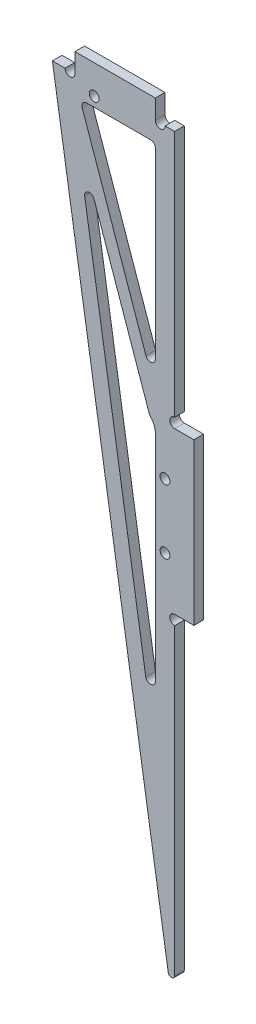
ISO-10303-21;
HEADER;
FILE_DESCRIPTION(('STEP AP214'),'2;1');
FILE_NAME('part.step','',(''),(''),'','','');
FILE_SCHEMA(('AUTOMOTIVE_DESIGN { 1 0 10303 214 1 1 1 1 }'));
ENDSEC;
DATA;
#1=APPLICATION_CONTEXT('core data for automotive mechanical design processes');
#2=APPLICATION_PROTOCOL_DEFINITION('international standard','automotive_design',2000,#1);
#3=PRODUCT_CONTEXT('',#1,'mechanical');
#4=PRODUCT('Part','Part','',(#3));
#5=PRODUCT_RELATED_PRODUCT_CATEGORY('part','',(#4));
#6=PRODUCT_DEFINITION_FORMATION('','',#4);
#7=PRODUCT_DEFINITION_CONTEXT('part definition',#1,'design');
#8=PRODUCT_DEFINITION('design','',#6,#7);
#9=PRODUCT_DEFINITION_SHAPE('','',#8);
#10=(LENGTH_UNIT() NAMED_UNIT(*) SI_UNIT(.MILLI.,.METRE.));
#11=(NAMED_UNIT(*) PLANE_ANGLE_UNIT() SI_UNIT($,.RADIAN.));
#12=(NAMED_UNIT(*) SI_UNIT($,.STERADIAN.) SOLID_ANGLE_UNIT());
#13=UNCERTAINTY_MEASURE_WITH_UNIT(LENGTH_MEASURE(1.E-05),#10,'distance_accuracy_value','');
#14=(GEOMETRIC_REPRESENTATION_CONTEXT(3) GLOBAL_UNCERTAINTY_ASSIGNED_CONTEXT((#13)) GLOBAL_UNIT_ASSIGNED_CONTEXT((#10,
#11,#12)) REPRESENTATION_CONTEXT('',''));
#15=CARTESIAN_POINT('',(0.,0.,0.));
#16=DIRECTION('',(0.,0.,1.));
#17=DIRECTION('',(1.,0.,0.));
#18=AXIS2_PLACEMENT_3D('',#15,#16,#17);
#19=CARTESIAN_POINT('',(-5.99999999999994,-5.99999999999979,60.));
#20=DIRECTION('',(1.,0.,0.));
#21=DIRECTION('',(0.,1.,0.));
#22=AXIS2_PLACEMENT_3D('',#19,#20,#21);
#23=PLANE('',#22);
#24=DIRECTION('',(0.,-1.,0.));
#25=VECTOR('',#24,1.);
#26=CARTESIAN_POINT('',(-5.99999999999994,0.,3.));
#27=LINE('',#26,#25);
#28=CARTESIAN_POINT('',(-5.99999999999995,-84.1827541414039,3.));
#29=VERTEX_POINT('',#28);
#30=CARTESIAN_POINT('',(-5.99999999999996,-151.067549311675,3.));
#31=VERTEX_POINT('',#30);
#32=EDGE_CURVE('E265',#29,#31,#27,.T.);
#33=ORIENTED_EDGE('',*,*,#32,.F.);
#34=DIRECTION('',(0.,0.,-1.));
#35=VECTOR('',#34,1.);
#36=CARTESIAN_POINT('',(-5.99999999999995,-84.1827541414039,60.));
#37=LINE('',#36,#35);
#38=CARTESIAN_POINT('',(-5.99999999999995,-84.1827541414039,0.));
#39=VERTEX_POINT('',#38);
#40=EDGE_CURVE('E435',#29,#39,#37,.T.);
#41=ORIENTED_EDGE('',*,*,#40,.T.);
#42=DIRECTION('',(0.,-1.,0.));
#43=VECTOR('',#42,1.);
#44=CARTESIAN_POINT('',(-5.99999999999994,-5.99999999999979,0.));
#45=LINE('',#44,#43);
#46=CARTESIAN_POINT('',(-5.99999999999996,-151.067549311675,0.));
#47=VERTEX_POINT('',#46);
#48=EDGE_CURVE('E258',#39,#47,#45,.T.);
#49=ORIENTED_EDGE('',*,*,#48,.T.);
#50=DIRECTION('',(0.,0.,-1.));
#51=VECTOR('',#50,1.);
#52=CARTESIAN_POINT('',(-5.99999999999996,-151.067549311675,3.));
#53=LINE('',#52,#51);
#54=EDGE_CURVE('E419',#47,#31,#53,.F.);
#55=ORIENTED_EDGE('',*,*,#54,.T.);
#56=EDGE_LOOP('',(#33,#41,#49,#55));
#57=FACE_BOUND('',#56,.T.);
#58=ADVANCED_FACE('F33',(#57),#23,.F.);
#59=CARTESIAN_POINT('',(0.,0.,3.));
#60=DIRECTION('',(-1.,0.,0.));
#61=DIRECTION('',(0.,-1.,0.));
#62=AXIS2_PLACEMENT_3D('',#59,#60,#61);
#63=PLANE('',#62);
#64=DIRECTION('',(0.,1.,0.));
#65=VECTOR('',#64,1.);
#66=CARTESIAN_POINT('',(0.,0.,3.));
#67=LINE('',#66,#65);
#68=CARTESIAN_POINT('',(0.,-76.9499999999999,3.));
#69=VERTEX_POINT('',#68);
#70=CARTESIAN_POINT('',(0.,0.,3.));
#71=VERTEX_POINT('',#70);
#72=EDGE_CURVE('E373',#69,#71,#67,.T.);
#73=ORIENTED_EDGE('',*,*,#72,.F.);
#74=DIRECTION('',(0.,0.,-1.));
#75=VECTOR('',#74,1.);
#76=CARTESIAN_POINT('',(0.,-76.9499999999999,40.));
#77=LINE('',#76,#75);
#78=CARTESIAN_POINT('',(0.,-76.9499999999999,0.));
#79=VERTEX_POINT('',#78);
#80=EDGE_CURVE('E285',#69,#79,#77,.T.);
#81=ORIENTED_EDGE('',*,*,#80,.T.);
#82=DIRECTION('',(0.,1.,0.));
#83=VECTOR('',#82,1.);
#84=CARTESIAN_POINT('',(0.,0.,0.));
#85=LINE('',#84,#83);
#86=CARTESIAN_POINT('',(0.,0.,0.));
#87=VERTEX_POINT('',#86);
#88=EDGE_CURVE('E385',#79,#87,#85,.T.);
#89=ORIENTED_EDGE('',*,*,#88,.T.);
#90=DIRECTION('',(0.,0.,-1.));
#91=VECTOR('',#90,1.);
#92=CARTESIAN_POINT('',(0.,0.,3.));
#93=LINE('',#92,#91);
#94=EDGE_CURVE('E394',#71,#87,#93,.T.);
#95=ORIENTED_EDGE('',*,*,#94,.F.);
#96=EDGE_LOOP('',(#73,#81,#89,#95));
#97=FACE_BOUND('',#96,.T.);
#98=ADVANCED_FACE('F515',(#97),#63,.F.);
#99=CARTESIAN_POINT('',(-38.,0.,3.));
#100=DIRECTION('',(0.,-1.,0.));
#101=DIRECTION('',(0.,0.,-1.));
#102=AXIS2_PLACEMENT_3D('',#99,#100,#101);
#103=PLANE('',#102);
#104=DIRECTION('',(-1.,0.,0.));
#105=VECTOR('',#104,1.);
#106=CARTESIAN_POINT('',(-38.,0.,3.));
#107=LINE('',#106,#105);
#108=CARTESIAN_POINT('',(-34.05,0.,3.));
#109=VERTEX_POINT('',#108);
#110=CARTESIAN_POINT('',(-38.,0.,3.));
#111=VERTEX_POINT('',#110);
#112=EDGE_CURVE('E377',#109,#111,#107,.T.);
#113=ORIENTED_EDGE('',*,*,#112,.F.);
#114=DIRECTION('',(0.,0.,-1.));
#115=VECTOR('',#114,1.);
#116=CARTESIAN_POINT('',(-34.05,0.,40.));
#117=LINE('',#116,#115);
#118=CARTESIAN_POINT('',(-34.05,0.,0.));
#119=VERTEX_POINT('',#118);
#120=EDGE_CURVE('E297',#109,#119,#117,.T.);
#121=ORIENTED_EDGE('',*,*,#120,.T.);
#122=DIRECTION('',(-1.,0.,0.));
#123=VECTOR('',#122,1.);
#124=CARTESIAN_POINT('',(-38.,0.,0.));
#125=LINE('',#124,#123);
#126=CARTESIAN_POINT('',(-38.,0.,0.));
#127=VERTEX_POINT('',#126);
#128=EDGE_CURVE('E389',#119,#127,#125,.T.);
#129=ORIENTED_EDGE('',*,*,#128,.T.);
#130=DIRECTION('',(0.,0.,-1.));
#131=VECTOR('',#130,1.);
#132=CARTESIAN_POINT('',(-38.,0.,3.));
#133=LINE('',#132,#131);
#134=EDGE_CURVE('E381',#111,#127,#133,.T.);
#135=ORIENTED_EDGE('',*,*,#134,.F.);
#136=EDGE_LOOP('',(#113,#121,#129,#135));
#137=FACE_BOUND('',#136,.T.);
#138=ADVANCED_FACE('F520',(#137),#103,.F.);
#139=CARTESIAN_POINT('',(0.,-240.,3.));
#140=DIRECTION('',(0.987696138674997,0.156385221956875,0.));
#141=DIRECTION('',(-0.156385221956875,0.987696138674997,0.));
#142=AXIS2_PLACEMENT_3D('',#139,#140,#141);
#143=PLANE('',#142);
#144=DIRECTION('',(0.156385221956875,-0.987696138674997,0.));
#145=VECTOR('',#144,1.);
#146=CARTESIAN_POINT('',(0.,-240.,0.));
#147=LINE('',#146,#145);
#148=CARTESIAN_POINT('',(-1.98769613867497,-227.446129650474,0.));
#149=VERTEX_POINT('',#148);
#150=EDGE_CURVE('E382',#127,#149,#147,.T.);
#151=ORIENTED_EDGE('',*,*,#150,.T.);
#152=DIRECTION('',(0.,0.,-1.));
#153=VECTOR('',#152,1.);
#154=CARTESIAN_POINT('',(-1.98769613867497,-227.446129650474,3.));
#155=LINE('',#154,#153);
#156=CARTESIAN_POINT('',(-1.98769613867497,-227.446129650474,3.));
#157=VERTEX_POINT('',#156);
#158=EDGE_CURVE('E409',#149,#157,#155,.F.);
#159=ORIENTED_EDGE('',*,*,#158,.T.);
#160=DIRECTION('',(0.156385221956875,-0.987696138674997,0.));
#161=VECTOR('',#160,1.);
#162=CARTESIAN_POINT('',(0.,-240.,3.));
#163=LINE('',#162,#161);
#164=EDGE_CURVE('E370',#111,#157,#163,.T.);
#165=ORIENTED_EDGE('',*,*,#164,.F.);
#166=ORIENTED_EDGE('',*,*,#134,.T.);
#167=EDGE_LOOP('',(#151,#159,#165,#166));
#168=FACE_BOUND('',#167,.T.);
#169=ADVANCED_FACE('F627',(#168),#143,.F.);
#170=CARTESIAN_POINT('',(0.,-227.289744428517,3.));
#171=VERTEX_POINT('',#170);
#172=CARTESIAN_POINT('',(0.,-133.05,3.));
#173=VERTEX_POINT('',#172);
#174=EDGE_CURVE('E375',#171,#173,#67,.T.);
#175=ORIENTED_EDGE('',*,*,#174,.F.);
#176=DIRECTION('',(0.,0.,-1.));
#177=VECTOR('',#176,1.);
#178=CARTESIAN_POINT('',(0.,-227.289744428517,3.));
#179=LINE('',#178,#177);
#180=CARTESIAN_POINT('',(0.,-227.289744428517,0.));
#181=VERTEX_POINT('',#180);
#182=EDGE_CURVE('E397',#171,#181,#179,.T.);
#183=ORIENTED_EDGE('',*,*,#182,.T.);
#184=CARTESIAN_POINT('',(0.,-133.05,0.));
#185=VERTEX_POINT('',#184);
#186=EDGE_CURVE('E387',#181,#185,#85,.T.);
#187=ORIENTED_EDGE('',*,*,#186,.T.);
#188=DIRECTION('',(0.,0.,-1.));
#189=VECTOR('',#188,1.);
#190=CARTESIAN_POINT('',(0.,-133.05,40.));
#191=LINE('',#190,#189);
#192=EDGE_CURVE('E291',#185,#173,#191,.F.);
#193=ORIENTED_EDGE('',*,*,#192,.T.);
#194=EDGE_LOOP('',(#175,#183,#187,#193));
#195=FACE_BOUND('',#194,.T.);
#196=ADVANCED_FACE('F523',(#195),#63,.F.);
#197=CARTESIAN_POINT('',(-2.95,0.,0.));
#198=VERTEX_POINT('',#197);
#199=EDGE_CURVE('E374',#87,#198,#125,.T.);
#200=ORIENTED_EDGE('',*,*,#199,.T.);
#201=DIRECTION('',(0.,0.,-1.));
#202=VECTOR('',#201,1.);
#203=CARTESIAN_POINT('',(-2.95,0.,40.));
#204=LINE('',#203,#202);
#205=CARTESIAN_POINT('',(-2.95,0.,3.));
#206=VERTEX_POINT('',#205);
#207=EDGE_CURVE('E303',#198,#206,#204,.F.);
#208=ORIENTED_EDGE('',*,*,#207,.T.);
#209=EDGE_CURVE('E378',#71,#206,#107,.T.);
#210=ORIENTED_EDGE('',*,*,#209,.F.);
#211=ORIENTED_EDGE('',*,*,#94,.T.);
#212=EDGE_LOOP('',(#200,#208,#210,#211));
#213=FACE_BOUND('',#212,.T.);
#214=ADVANCED_FACE('F565',(#213),#103,.F.);
#215=CARTESIAN_POINT('',(0.,0.,3.));
#216=DIRECTION('',(0.,0.,-1.));
#217=DIRECTION('',(-1.,0.,0.));
#218=AXIS2_PLACEMENT_3D('',#215,#216,#217);
#219=PLANE('',#218);
#220=CARTESIAN_POINT('',(-5.99999999999995,-79.2837746558375,3.));
#221=DIRECTION('',(0.,0.,-1.));
#222=DIRECTION('',(-1.,0.,0.));
#223=AXIS2_PLACEMENT_3D('',#220,#221,#222);
#224=CIRCLE('',#223,2.);
#225=CARTESIAN_POINT('',(-7.88846957543033,-79.9423205256703,3.));
#226=VERTEX_POINT('',#225);
#227=CARTESIAN_POINT('',(-7.42857142857137,-80.6834830802851,3.));
#228=VERTEX_POINT('',#227);
#229=EDGE_CURVE('E240',#226,#228,#224,.F.);
#230=ORIENTED_EDGE('',*,*,#229,.T.);
#231=CARTESIAN_POINT('',(-10.9999999999999,-84.1827541414039,3.));
#232=DIRECTION('',(0.,0.,-1.));
#233=DIRECTION('',(-1.,0.,0.));
#234=AXIS2_PLACEMENT_3D('',#231,#232,#233);
#235=CIRCLE('',#234,5.);
#236=EDGE_CURVE('E441',#228,#29,#235,.T.);
#237=ORIENTED_EDGE('',*,*,#236,.T.);
#238=ORIENTED_EDGE('',*,*,#32,.T.);
#239=CARTESIAN_POINT('',(-7.49999999999996,-151.067549311675,3.));
#240=DIRECTION('',(0.,0.,-1.));
#241=DIRECTION('',(-1.,0.,0.));
#242=AXIS2_PLACEMENT_3D('',#239,#240,#241);
#243=CIRCLE('',#242,1.5);
#244=CARTESIAN_POINT('',(-8.98154420801245,-151.302127144611,3.));
#245=VERTEX_POINT('',#244);
#246=EDGE_CURVE('E428',#31,#245,#243,.T.);
#247=ORIENTED_EDGE('',*,*,#246,.T.);
#248=DIRECTION('',(-0.156385221956875,0.987696138674997,0.));
#249=VECTOR('',#248,1.);
#250=CARTESIAN_POINT('',(-32.132178476058,-5.08759492537584,3.));
#251=LINE('',#250,#249);
#252=CARTESIAN_POINT('',(-27.9643827139141,-31.4105155283896,3.));
#253=VERTEX_POINT('',#252);
#254=EDGE_CURVE('E269',#245,#253,#251,.T.);
#255=ORIENTED_EDGE('',*,*,#254,.T.);
#256=CARTESIAN_POINT('',(-26.4828385059016,-31.1759376954543,3.));
#257=DIRECTION('',(0.,0.,-1.));
#258=DIRECTION('',(-1.,0.,0.));
#259=AXIS2_PLACEMENT_3D('',#256,#257,#258);
#260=CIRCLE('',#259,1.5);
#261=CARTESIAN_POINT('',(-25.0664863243288,-30.6820282930797,3.));
#262=VERTEX_POINT('',#261);
#263=EDGE_CURVE('E456',#253,#262,#260,.T.);
#264=ORIENTED_EDGE('',*,*,#263,.T.);
#265=DIRECTION('',(0.329272934916389,-0.944234787715189,0.));
#266=VECTOR('',#265,1.);
#267=CARTESIAN_POINT('',(-7.88846957543033,-79.9423205256703,3.));
#268=LINE('',#267,#266);
#269=EDGE_CURVE('E254',#262,#226,#268,.T.);
#270=ORIENTED_EDGE('',*,*,#269,.T.);
#271=EDGE_LOOP('',(#230,#237,#238,#247,#255,#264,#270));
#272=FACE_BOUND('',#271,.T.);
#273=CARTESIAN_POINT('',(-5.99999999999994,-7.49999999999979,3.));
#274=VERTEX_POINT('',#273);
#275=CARTESIAN_POINT('',(-5.99999999999995,-64.3528414990594,3.));
#276=VERTEX_POINT('',#275);
#277=EDGE_CURVE('E266',#274,#276,#27,.T.);
#278=ORIENTED_EDGE('',*,*,#277,.T.);
#279=CARTESIAN_POINT('',(-7.49999999999995,-64.3528414990594,3.));
#280=DIRECTION('',(0.,0.,-1.));
#281=DIRECTION('',(-1.,0.,0.));
#282=AXIS2_PLACEMENT_3D('',#279,#280,#281);
#283=CIRCLE('',#282,1.5);
#284=CARTESIAN_POINT('',(-8.91635218157273,-64.8467509014339,3.));
#285=VERTEX_POINT('',#284);
#286=EDGE_CURVE('E460',#276,#285,#283,.T.);
#287=ORIENTED_EDGE('',*,*,#286,.T.);
#288=DIRECTION('',(-0.329272934916389,0.944234787715189,0.));
#289=VECTOR('',#288,1.);
#290=CARTESIAN_POINT('',(-4.11153042456958,-78.6252287860048,3.));
#291=LINE('',#290,#289);
#292=CARTESIAN_POINT('',(-28.7420377232266,-7.99390940237434,3.));
#293=VERTEX_POINT('',#292);
#294=EDGE_CURVE('E243',#285,#293,#291,.T.);
#295=ORIENTED_EDGE('',*,*,#294,.T.);
#296=CARTESIAN_POINT('',(-27.3256855416538,-7.49999999999978,3.));
#297=DIRECTION('',(0.,0.,-1.));
#298=DIRECTION('',(-1.,0.,0.));
#299=AXIS2_PLACEMENT_3D('',#296,#297,#298);
#300=CIRCLE('',#299,1.5);
#301=CARTESIAN_POINT('',(-27.3256855416538,-5.99999999999978,3.));
#302=VERTEX_POINT('',#301);
#303=EDGE_CURVE('E11',#293,#302,#300,.T.);
#304=ORIENTED_EDGE('',*,*,#303,.T.);
#305=DIRECTION('',(1.,0.,0.));
#306=VECTOR('',#305,1.);
#307=CARTESIAN_POINT('',(0.,-5.99999999999979,3.));
#308=LINE('',#307,#306);
#309=CARTESIAN_POINT('',(-7.49999999999994,-5.99999999999978,3.));
#310=VERTEX_POINT('',#309);
#311=EDGE_CURVE('E272',#302,#310,#308,.T.);
#312=ORIENTED_EDGE('',*,*,#311,.T.);
#313=CARTESIAN_POINT('',(-7.49999999999994,-7.49999999999979,3.));
#314=DIRECTION('',(0.,0.,-1.));
#315=DIRECTION('',(-1.,0.,0.));
#316=AXIS2_PLACEMENT_3D('',#313,#314,#315);
#317=CIRCLE('',#316,1.5);
#318=EDGE_CURVE('E433',#310,#274,#317,.T.);
#319=ORIENTED_EDGE('',*,*,#318,.T.);
#320=EDGE_LOOP('',(#278,#287,#295,#304,#312,#319));
#321=FACE_BOUND('',#320,.T.);
#322=CARTESIAN_POINT('',(-3.,-115.,3.));
#323=DIRECTION('',(0.,0.,1.));
#324=DIRECTION('',(1.,0.,0.));
#325=AXIS2_PLACEMENT_3D('',#322,#323,#324);
#326=CIRCLE('',#325,1.52500000000009);
#327=CARTESIAN_POINT('',(-1.47499999999992,-115.,3.));
#328=VERTEX_POINT('',#327);
#329=EDGE_CURVE('E361',#328,#328,#326,.T.);
#330=ORIENTED_EDGE('',*,*,#329,.F.);
#331=EDGE_LOOP('',(#330));
#332=FACE_BOUND('',#331,.T.);
#333=CARTESIAN_POINT('',(-3.00000000000001,-95.0000000000001,3.));
#334=DIRECTION('',(0.,0.,1.));
#335=DIRECTION('',(1.,0.,0.));
#336=AXIS2_PLACEMENT_3D('',#333,#334,#335);
#337=CIRCLE('',#336,1.52500000000009);
#338=CARTESIAN_POINT('',(-1.47499999999992,-95.0000000000001,3.));
#339=VERTEX_POINT('',#338);
#340=EDGE_CURVE('E365',#339,#339,#337,.T.);
#341=ORIENTED_EDGE('',*,*,#340,.F.);
#342=EDGE_LOOP('',(#341));
#343=FACE_BOUND('',#342,.T.);
#344=CARTESIAN_POINT('',(-25.,-3.,3.));
#345=DIRECTION('',(0.,0.,1.));
#346=DIRECTION('',(1.,0.,0.));
#347=AXIS2_PLACEMENT_3D('',#344,#345,#346);
#348=CIRCLE('',#347,1.52499999999993);
#349=CARTESIAN_POINT('',(-23.475,-3.,3.));
#350=VERTEX_POINT('',#349);
#351=EDGE_CURVE('E360',#350,#350,#348,.T.);
#352=ORIENTED_EDGE('',*,*,#351,.F.);
#353=EDGE_LOOP('',(#352));
#354=FACE_BOUND('',#353,.T.);
#355=ORIENTED_EDGE('',*,*,#164,.T.);
#356=CARTESIAN_POINT('',(-0.999999999999972,-227.289744428517,3.));
#357=DIRECTION('',(0.,0.,-1.));
#358=DIRECTION('',(-1.,0.,0.));
#359=AXIS2_PLACEMENT_3D('',#356,#357,#358);
#360=CIRCLE('',#359,1.);
#361=EDGE_CURVE('E411',#157,#171,#360,.F.);
#362=ORIENTED_EDGE('',*,*,#361,.T.);
#363=ORIENTED_EDGE('',*,*,#174,.T.);
#364=CARTESIAN_POINT('',(0.,-131.525,3.));
#365=DIRECTION('',(0.,0.,-1.));
#366=DIRECTION('',(-1.,0.,0.));
#367=AXIS2_PLACEMENT_3D('',#364,#365,#366);
#368=CIRCLE('',#367,1.525);
#369=CARTESIAN_POINT('',(0.,-130.,3.));
#370=VERTEX_POINT('',#369);
#371=EDGE_CURVE('E288',#173,#370,#368,.T.);
#372=ORIENTED_EDGE('',*,*,#371,.T.);
#373=DIRECTION('',(1.,0.,0.));
#374=VECTOR('',#373,1.);
#375=CARTESIAN_POINT('',(0.,-130.,3.));
#376=LINE('',#375,#374);
#377=CARTESIAN_POINT('',(6.00000000000004,-130.,3.));
#378=VERTEX_POINT('',#377);
#379=EDGE_CURVE('E306',#370,#378,#376,.T.);
#380=ORIENTED_EDGE('',*,*,#379,.T.);
#381=DIRECTION('',(0.,1.,0.));
#382=VECTOR('',#381,1.);
#383=CARTESIAN_POINT('',(6.00000000000003,-79.9999999999999,3.));
#384=LINE('',#383,#382);
#385=CARTESIAN_POINT('',(6.00000000000003,-79.9999999999999,3.));
#386=VERTEX_POINT('',#385);
#387=EDGE_CURVE('E311',#378,#386,#384,.T.);
#388=ORIENTED_EDGE('',*,*,#387,.T.);
#389=DIRECTION('',(-1.,0.,0.));
#390=VECTOR('',#389,1.);
#391=CARTESIAN_POINT('',(0.,-79.9999999999999,3.));
#392=LINE('',#391,#390);
#393=CARTESIAN_POINT('',(0.,-79.9999999999999,3.));
#394=VERTEX_POINT('',#393);
#395=EDGE_CURVE('E307',#386,#394,#392,.T.);
#396=ORIENTED_EDGE('',*,*,#395,.T.);
#397=CARTESIAN_POINT('',(0.,-78.4749999999999,3.));
#398=DIRECTION('',(0.,0.,-1.));
#399=DIRECTION('',(-1.,0.,0.));
#400=AXIS2_PLACEMENT_3D('',#397,#398,#399);
#401=CIRCLE('',#400,1.525);
#402=EDGE_CURVE('E282',#394,#69,#401,.T.);
#403=ORIENTED_EDGE('',*,*,#402,.T.);
#404=ORIENTED_EDGE('',*,*,#72,.T.);
#405=ORIENTED_EDGE('',*,*,#209,.T.);
#406=CARTESIAN_POINT('',(-4.475,0.,3.));
#407=DIRECTION('',(0.,0.,-1.));
#408=DIRECTION('',(-1.,0.,0.));
#409=AXIS2_PLACEMENT_3D('',#406,#407,#408);
#410=CIRCLE('',#409,1.525);
#411=CARTESIAN_POINT('',(-6.,0.,3.));
#412=VERTEX_POINT('',#411);
#413=EDGE_CURVE('E300',#206,#412,#410,.T.);
#414=ORIENTED_EDGE('',*,*,#413,.T.);
#415=DIRECTION('',(0.,1.,0.));
#416=VECTOR('',#415,1.);
#417=CARTESIAN_POINT('',(-6.,0.,3.));
#418=LINE('',#417,#416);
#419=CARTESIAN_POINT('',(-6.,6.,3.));
#420=VERTEX_POINT('',#419);
#421=EDGE_CURVE('E338',#412,#420,#418,.T.);
#422=ORIENTED_EDGE('',*,*,#421,.T.);
#423=DIRECTION('',(-1.,0.,0.));
#424=VECTOR('',#423,1.);
#425=CARTESIAN_POINT('',(-31.,6.,3.));
#426=LINE('',#425,#424);
#427=CARTESIAN_POINT('',(-31.,6.,3.));
#428=VERTEX_POINT('',#427);
#429=EDGE_CURVE('E334',#420,#428,#426,.T.);
#430=ORIENTED_EDGE('',*,*,#429,.T.);
#431=DIRECTION('',(0.,-1.,0.));
#432=VECTOR('',#431,1.);
#433=CARTESIAN_POINT('',(-31.,0.,3.));
#434=LINE('',#433,#432);
#435=CARTESIAN_POINT('',(-31.,0.,3.));
#436=VERTEX_POINT('',#435);
#437=EDGE_CURVE('E333',#428,#436,#434,.T.);
#438=ORIENTED_EDGE('',*,*,#437,.T.);
#439=CARTESIAN_POINT('',(-32.525,0.,3.));
#440=DIRECTION('',(0.,0.,-1.));
#441=DIRECTION('',(-1.,0.,0.));
#442=AXIS2_PLACEMENT_3D('',#439,#440,#441);
#443=CIRCLE('',#442,1.525);
#444=EDGE_CURVE('E294',#436,#109,#443,.T.);
#445=ORIENTED_EDGE('',*,*,#444,.T.);
#446=ORIENTED_EDGE('',*,*,#112,.T.);
#447=EDGE_LOOP('',(#355,#362,#363,#372,#380,#388,#396,#403,#404,#405,#414,#422,#430,#438,#445,#446));
#448=FACE_BOUND('',#447,.T.);
#449=ADVANCED_FACE('F475',(#272,#321,#332,#343,#354,#448),#219,.F.);
#450=CARTESIAN_POINT('',(0.,0.,0.));
#451=DIRECTION('',(0.,0.,-1.));
#452=DIRECTION('',(-1.,0.,0.));
#453=AXIS2_PLACEMENT_3D('',#450,#451,#452);
#454=PLANE('',#453);
#455=ORIENTED_EDGE('',*,*,#48,.F.);
#456=CARTESIAN_POINT('',(-10.9999999999999,-84.1827541414039,0.));
#457=DIRECTION('',(0.,0.,-1.));
#458=DIRECTION('',(-1.,0.,0.));
#459=AXIS2_PLACEMENT_3D('',#456,#457,#458);
#460=CIRCLE('',#459,5.);
#461=CARTESIAN_POINT('',(-7.42857142857137,-80.6834830802851,0.));
#462=VERTEX_POINT('',#461);
#463=EDGE_CURVE('E231',#39,#462,#460,.F.);
#464=ORIENTED_EDGE('',*,*,#463,.T.);
#465=CARTESIAN_POINT('',(-5.99999999999995,-79.2837746558375,0.));
#466=DIRECTION('',(0.,0.,-1.));
#467=DIRECTION('',(1.,0.,0.));
#468=AXIS2_PLACEMENT_3D('',#465,#466,#467);
#469=CIRCLE('',#468,2.);
#470=CARTESIAN_POINT('',(-7.88846957543033,-79.9423205256703,0.));
#471=VERTEX_POINT('',#470);
#472=EDGE_CURVE('E223',#462,#471,#469,.T.);
#473=ORIENTED_EDGE('',*,*,#472,.T.);
#474=DIRECTION('',(-0.329272934916389,0.944234787715189,0.));
#475=VECTOR('',#474,1.);
#476=CARTESIAN_POINT('',(-7.88846957543033,-79.9423205256703,0.));
#477=LINE('',#476,#475);
#478=CARTESIAN_POINT('',(-25.0664863243288,-30.6820282930797,0.));
#479=VERTEX_POINT('',#478);
#480=EDGE_CURVE('E229',#471,#479,#477,.T.);
#481=ORIENTED_EDGE('',*,*,#480,.T.);
#482=CARTESIAN_POINT('',(-26.4828385059016,-31.1759376954543,0.));
#483=DIRECTION('',(0.,0.,-1.));
#484=DIRECTION('',(-1.,0.,0.));
#485=AXIS2_PLACEMENT_3D('',#482,#483,#484);
#486=CIRCLE('',#485,1.5);
#487=CARTESIAN_POINT('',(-27.9643827139141,-31.4105155283896,0.));
#488=VERTEX_POINT('',#487);
#489=EDGE_CURVE('E458',#479,#488,#486,.F.);
#490=ORIENTED_EDGE('',*,*,#489,.T.);
#491=DIRECTION('',(-0.156385221956875,0.987696138674997,0.));
#492=VECTOR('',#491,1.);
#493=CARTESIAN_POINT('',(-5.99999999999996,-170.1329326689,0.));
#494=LINE('',#493,#492);
#495=CARTESIAN_POINT('',(-8.98154420801245,-151.302127144611,0.));
#496=VERTEX_POINT('',#495);
#497=EDGE_CURVE('E262',#496,#488,#494,.T.);
#498=ORIENTED_EDGE('',*,*,#497,.F.);
#499=CARTESIAN_POINT('',(-7.49999999999996,-151.067549311675,0.));
#500=DIRECTION('',(0.,0.,-1.));
#501=DIRECTION('',(-1.,0.,0.));
#502=AXIS2_PLACEMENT_3D('',#499,#500,#501);
#503=CIRCLE('',#502,1.5);
#504=EDGE_CURVE('E425',#496,#47,#503,.F.);
#505=ORIENTED_EDGE('',*,*,#504,.T.);
#506=EDGE_LOOP('',(#455,#464,#473,#481,#490,#498,#505));
#507=FACE_BOUND('',#506,.T.);
#508=DIRECTION('',(1.,0.,0.));
#509=VECTOR('',#508,1.);
#510=CARTESIAN_POINT('',(-31.9877143392425,-5.99999999999978,0.));
#511=LINE('',#510,#509);
#512=CARTESIAN_POINT('',(-27.3256855416538,-5.99999999999978,0.));
#513=VERTEX_POINT('',#512);
#514=CARTESIAN_POINT('',(-7.49999999999994,-5.99999999999979,0.));
#515=VERTEX_POINT('',#514);
#516=EDGE_CURVE('E256',#513,#515,#511,.T.);
#517=ORIENTED_EDGE('',*,*,#516,.F.);
#518=CARTESIAN_POINT('',(-27.3256855416538,-7.49999999999978,0.));
#519=DIRECTION('',(0.,0.,-1.));
#520=DIRECTION('',(-1.,0.,0.));
#521=AXIS2_PLACEMENT_3D('',#518,#519,#520);
#522=CIRCLE('',#521,1.5);
#523=CARTESIAN_POINT('',(-28.7420377232266,-7.99390940237435,0.));
#524=VERTEX_POINT('',#523);
#525=EDGE_CURVE('E41',#513,#524,#522,.F.);
#526=ORIENTED_EDGE('',*,*,#525,.T.);
#527=DIRECTION('',(0.329272934916389,-0.944234787715189,0.));
#528=VECTOR('',#527,1.);
#529=CARTESIAN_POINT('',(-4.11153042456958,-78.6252287860048,0.));
#530=LINE('',#529,#528);
#531=CARTESIAN_POINT('',(-8.91635218157273,-64.8467509014339,0.));
#532=VERTEX_POINT('',#531);
#533=EDGE_CURVE('E244',#524,#532,#530,.T.);
#534=ORIENTED_EDGE('',*,*,#533,.T.);
#535=CARTESIAN_POINT('',(-7.49999999999995,-64.3528414990594,0.));
#536=DIRECTION('',(0.,0.,-1.));
#537=DIRECTION('',(-1.,0.,0.));
#538=AXIS2_PLACEMENT_3D('',#535,#536,#537);
#539=CIRCLE('',#538,1.5);
#540=CARTESIAN_POINT('',(-5.99999999999995,-64.3528414990594,0.));
#541=VERTEX_POINT('',#540);
#542=EDGE_CURVE('E462',#532,#541,#539,.F.);
#543=ORIENTED_EDGE('',*,*,#542,.T.);
#544=CARTESIAN_POINT('',(-5.99999999999994,-7.49999999999979,0.));
#545=VERTEX_POINT('',#544);
#546=EDGE_CURVE('E259',#545,#541,#45,.T.);
#547=ORIENTED_EDGE('',*,*,#546,.F.);
#548=CARTESIAN_POINT('',(-7.49999999999994,-7.49999999999979,0.));
#549=DIRECTION('',(0.,0.,-1.));
#550=DIRECTION('',(-1.,0.,0.));
#551=AXIS2_PLACEMENT_3D('',#548,#549,#550);
#552=CIRCLE('',#551,1.5);
#553=EDGE_CURVE('E430',#545,#515,#552,.F.);
#554=ORIENTED_EDGE('',*,*,#553,.T.);
#555=EDGE_LOOP('',(#517,#526,#534,#543,#547,#554));
#556=FACE_BOUND('',#555,.T.);
#557=ORIENTED_EDGE('',*,*,#186,.F.);
#558=CARTESIAN_POINT('',(-0.999999999999972,-227.289744428517,0.));
#559=DIRECTION('',(0.,0.,-1.));
#560=DIRECTION('',(-1.,0.,0.));
#561=AXIS2_PLACEMENT_3D('',#558,#559,#560);
#562=CIRCLE('',#561,1.);
#563=EDGE_CURVE('E407',#181,#149,#562,.T.);
#564=ORIENTED_EDGE('',*,*,#563,.T.);
#565=ORIENTED_EDGE('',*,*,#150,.F.);
#566=ORIENTED_EDGE('',*,*,#128,.F.);
#567=CARTESIAN_POINT('',(-32.525,0.,0.));
#568=DIRECTION('',(0.,0.,-1.));
#569=DIRECTION('',(-1.,0.,0.));
#570=AXIS2_PLACEMENT_3D('',#567,#568,#569);
#571=CIRCLE('',#570,1.525);
#572=CARTESIAN_POINT('',(-31.,0.,0.));
#573=VERTEX_POINT('',#572);
#574=EDGE_CURVE('E274',#573,#119,#571,.T.);
#575=ORIENTED_EDGE('',*,*,#574,.F.);
#576=DIRECTION('',(0.,-1.,0.));
#577=VECTOR('',#576,1.);
#578=CARTESIAN_POINT('',(-31.,0.,0.));
#579=LINE('',#578,#577);
#580=CARTESIAN_POINT('',(-31.,6.,0.));
#581=VERTEX_POINT('',#580);
#582=EDGE_CURVE('E343',#581,#573,#579,.T.);
#583=ORIENTED_EDGE('',*,*,#582,.F.);
#584=DIRECTION('',(-1.,0.,0.));
#585=VECTOR('',#584,1.);
#586=CARTESIAN_POINT('',(-31.,6.,0.));
#587=LINE('',#586,#585);
#588=CARTESIAN_POINT('',(-6.,6.,0.));
#589=VERTEX_POINT('',#588);
#590=EDGE_CURVE('E348',#589,#581,#587,.T.);
#591=ORIENTED_EDGE('',*,*,#590,.F.);
#592=DIRECTION('',(0.,1.,0.));
#593=VECTOR('',#592,1.);
#594=CARTESIAN_POINT('',(-6.,0.,0.));
#595=LINE('',#594,#593);
#596=CARTESIAN_POINT('',(-6.,0.,0.));
#597=VERTEX_POINT('',#596);
#598=EDGE_CURVE('E352',#597,#589,#595,.T.);
#599=ORIENTED_EDGE('',*,*,#598,.F.);
#600=CARTESIAN_POINT('',(-4.475,0.,0.));
#601=DIRECTION('',(0.,0.,-1.));
#602=DIRECTION('',(-1.,0.,0.));
#603=AXIS2_PLACEMENT_3D('',#600,#601,#602);
#604=CIRCLE('',#603,1.525);
#605=EDGE_CURVE('E278',#198,#597,#604,.T.);
#606=ORIENTED_EDGE('',*,*,#605,.F.);
#607=ORIENTED_EDGE('',*,*,#199,.F.);
#608=ORIENTED_EDGE('',*,*,#88,.F.);
#609=CARTESIAN_POINT('',(0.,-78.4749999999999,0.));
#610=DIRECTION('',(0.,0.,-1.));
#611=DIRECTION('',(-1.,0.,0.));
#612=AXIS2_PLACEMENT_3D('',#609,#610,#611);
#613=CIRCLE('',#612,1.525);
#614=CARTESIAN_POINT('',(0.,-79.9999999999999,0.));
#615=VERTEX_POINT('',#614);
#616=EDGE_CURVE('E277',#615,#79,#613,.T.);
#617=ORIENTED_EDGE('',*,*,#616,.F.);
#618=DIRECTION('',(-1.,0.,0.));
#619=VECTOR('',#618,1.);
#620=CARTESIAN_POINT('',(0.,-79.9999999999999,0.));
#621=LINE('',#620,#619);
#622=CARTESIAN_POINT('',(6.00000000000003,-79.9999999999999,0.));
#623=VERTEX_POINT('',#622);
#624=EDGE_CURVE('E319',#623,#615,#621,.T.);
#625=ORIENTED_EDGE('',*,*,#624,.F.);
#626=DIRECTION('',(0.,1.,0.));
#627=VECTOR('',#626,1.);
#628=CARTESIAN_POINT('',(6.00000000000003,-79.9999999999999,0.));
#629=LINE('',#628,#627);
#630=CARTESIAN_POINT('',(6.00000000000004,-130.,0.));
#631=VERTEX_POINT('',#630);
#632=EDGE_CURVE('E324',#631,#623,#629,.T.);
#633=ORIENTED_EDGE('',*,*,#632,.F.);
#634=DIRECTION('',(1.,0.,0.));
#635=VECTOR('',#634,1.);
#636=CARTESIAN_POINT('',(0.,-130.,0.));
#637=LINE('',#636,#635);
#638=CARTESIAN_POINT('',(0.,-130.,0.));
#639=VERTEX_POINT('',#638);
#640=EDGE_CURVE('E310',#639,#631,#637,.T.);
#641=ORIENTED_EDGE('',*,*,#640,.F.);
#642=CARTESIAN_POINT('',(0.,-131.525,0.));
#643=DIRECTION('',(0.,0.,-1.));
#644=DIRECTION('',(-1.,0.,0.));
#645=AXIS2_PLACEMENT_3D('',#642,#643,#644);
#646=CIRCLE('',#645,1.525);
#647=EDGE_CURVE('E275',#185,#639,#646,.T.);
#648=ORIENTED_EDGE('',*,*,#647,.F.);
#649=EDGE_LOOP('',(#557,#564,#565,#566,#575,#583,#591,#599,#606,#607,#608,#617,#625,#633,#641,#648));
#650=FACE_BOUND('',#649,.T.);
#651=CARTESIAN_POINT('',(-3.,-115.,0.));
#652=DIRECTION('',(0.,0.,-1.));
#653=DIRECTION('',(-1.,0.,0.));
#654=AXIS2_PLACEMENT_3D('',#651,#652,#653);
#655=CIRCLE('',#654,1.52500000000009);
#656=CARTESIAN_POINT('',(-4.52500000000009,-115.,0.));
#657=VERTEX_POINT('',#656);
#658=EDGE_CURVE('E386',#657,#657,#655,.T.);
#659=ORIENTED_EDGE('',*,*,#658,.F.);
#660=EDGE_LOOP('',(#659));
#661=FACE_BOUND('',#660,.T.);
#662=CARTESIAN_POINT('',(-3.00000000000001,-95.0000000000001,0.));
#663=DIRECTION('',(0.,0.,-1.));
#664=DIRECTION('',(-1.,0.,0.));
#665=AXIS2_PLACEMENT_3D('',#662,#663,#664);
#666=CIRCLE('',#665,1.52500000000009);
#667=CARTESIAN_POINT('',(-4.52500000000009,-95.0000000000001,0.));
#668=VERTEX_POINT('',#667);
#669=EDGE_CURVE('E400',#668,#668,#666,.T.);
#670=ORIENTED_EDGE('',*,*,#669,.F.);
#671=EDGE_LOOP('',(#670));
#672=FACE_BOUND('',#671,.T.);
#673=CARTESIAN_POINT('',(-25.,-3.,0.));
#674=DIRECTION('',(0.,0.,-1.));
#675=DIRECTION('',(-1.,0.,0.));
#676=AXIS2_PLACEMENT_3D('',#673,#674,#675);
#677=CIRCLE('',#676,1.52499999999993);
#678=CARTESIAN_POINT('',(-26.5249999999999,-3.,0.));
#679=VERTEX_POINT('',#678);
#680=EDGE_CURVE('E364',#679,#679,#677,.T.);
#681=ORIENTED_EDGE('',*,*,#680,.F.);
#682=EDGE_LOOP('',(#681));
#683=FACE_BOUND('',#682,.T.);
#684=ADVANCED_FACE('F226',(#507,#556,#650,#661,#672,#683),#454,.T.);
#685=CARTESIAN_POINT('',(-25.,-3.,-37.));
#686=DIRECTION('',(0.,0.,1.));
#687=DIRECTION('',(1.,0.,0.));
#688=AXIS2_PLACEMENT_3D('',#685,#686,#687);
#689=CYLINDRICAL_SURFACE('',#688,1.52499999999993);
#690=ORIENTED_EDGE('',*,*,#680,.T.);
#691=EDGE_LOOP('',(#690));
#692=FACE_BOUND('',#691,.T.);
#693=ORIENTED_EDGE('',*,*,#351,.T.);
#694=EDGE_LOOP('',(#693));
#695=FACE_BOUND('',#694,.T.);
#696=ADVANCED_FACE('F577',(#692,#695),#689,.F.);
#697=CARTESIAN_POINT('',(-3.00000000000001,-95.0000000000001,-37.));
#698=DIRECTION('',(0.,0.,1.));
#699=DIRECTION('',(1.,0.,0.));
#700=AXIS2_PLACEMENT_3D('',#697,#698,#699);
#701=CYLINDRICAL_SURFACE('',#700,1.52500000000009);
#702=ORIENTED_EDGE('',*,*,#669,.T.);
#703=EDGE_LOOP('',(#702));
#704=FACE_BOUND('',#703,.T.);
#705=ORIENTED_EDGE('',*,*,#340,.T.);
#706=EDGE_LOOP('',(#705));
#707=FACE_BOUND('',#706,.T.);
#708=ADVANCED_FACE('F767',(#704,#707),#701,.F.);
#709=CARTESIAN_POINT('',(-3.,-115.,-37.));
#710=DIRECTION('',(0.,0.,1.));
#711=DIRECTION('',(1.,0.,0.));
#712=AXIS2_PLACEMENT_3D('',#709,#710,#711);
#713=CYLINDRICAL_SURFACE('',#712,1.52500000000009);
#714=ORIENTED_EDGE('',*,*,#658,.T.);
#715=EDGE_LOOP('',(#714));
#716=FACE_BOUND('',#715,.T.);
#717=ORIENTED_EDGE('',*,*,#329,.T.);
#718=EDGE_LOOP('',(#717));
#719=FACE_BOUND('',#718,.T.);
#720=ADVANCED_FACE('F721',(#716,#719),#713,.F.);
#721=CARTESIAN_POINT('',(-6.,0.,-50.3587132480567));
#722=DIRECTION('',(1.,0.,0.));
#723=DIRECTION('',(0.,1.,0.));
#724=AXIS2_PLACEMENT_3D('',#721,#722,#723);
#725=PLANE('',#724);
#726=DIRECTION('',(0.,0.,1.));
#727=VECTOR('',#726,1.);
#728=CARTESIAN_POINT('',(-6.,0.,-50.3587132480567));
#729=LINE('',#728,#727);
#730=EDGE_CURVE('E337',#597,#412,#729,.T.);
#731=ORIENTED_EDGE('',*,*,#730,.F.);
#732=ORIENTED_EDGE('',*,*,#598,.T.);
#733=DIRECTION('',(0.,0.,1.));
#734=VECTOR('',#733,1.);
#735=CARTESIAN_POINT('',(-6.,6.,-50.3587132480567));
#736=LINE('',#735,#734);
#737=EDGE_CURVE('E351',#589,#420,#736,.T.);
#738=ORIENTED_EDGE('',*,*,#737,.T.);
#739=ORIENTED_EDGE('',*,*,#421,.F.);
#740=EDGE_LOOP('',(#731,#732,#738,#739));
#741=FACE_BOUND('',#740,.T.);
#742=ADVANCED_FACE('F716',(#741),#725,.T.);
#743=CARTESIAN_POINT('',(-31.,6.,-50.3587132480567));
#744=DIRECTION('',(0.,1.,0.));
#745=DIRECTION('',(0.,0.,1.));
#746=AXIS2_PLACEMENT_3D('',#743,#744,#745);
#747=PLANE('',#746);
#748=ORIENTED_EDGE('',*,*,#737,.F.);
#749=ORIENTED_EDGE('',*,*,#590,.T.);
#750=DIRECTION('',(0.,0.,1.));
#751=VECTOR('',#750,1.);
#752=CARTESIAN_POINT('',(-31.,6.,-50.3587132480567));
#753=LINE('',#752,#751);
#754=EDGE_CURVE('E347',#581,#428,#753,.T.);
#755=ORIENTED_EDGE('',*,*,#754,.T.);
#756=ORIENTED_EDGE('',*,*,#429,.F.);
#757=EDGE_LOOP('',(#748,#749,#755,#756));
#758=FACE_BOUND('',#757,.T.);
#759=ADVANCED_FACE('F708',(#758),#747,.T.);
#760=CARTESIAN_POINT('',(-31.,0.,-50.3587132480567));
#761=DIRECTION('',(-1.,0.,0.));
#762=DIRECTION('',(0.,0.,1.));
#763=AXIS2_PLACEMENT_3D('',#760,#761,#762);
#764=PLANE('',#763);
#765=ORIENTED_EDGE('',*,*,#754,.F.);
#766=ORIENTED_EDGE('',*,*,#582,.T.);
#767=DIRECTION('',(0.,0.,1.));
#768=VECTOR('',#767,1.);
#769=CARTESIAN_POINT('',(-31.,0.,-50.3587132480567));
#770=LINE('',#769,#768);
#771=EDGE_CURVE('E346',#573,#436,#770,.T.);
#772=ORIENTED_EDGE('',*,*,#771,.T.);
#773=ORIENTED_EDGE('',*,*,#437,.F.);
#774=EDGE_LOOP('',(#765,#766,#772,#773));
#775=FACE_BOUND('',#774,.T.);
#776=ADVANCED_FACE('F698',(#775),#764,.T.);
#777=CARTESIAN_POINT('',(0.,-130.,-50.3587132480567));
#778=DIRECTION('',(0.,-1.,0.));
#779=DIRECTION('',(0.,0.,-1.));
#780=AXIS2_PLACEMENT_3D('',#777,#778,#779);
#781=PLANE('',#780);
#782=DIRECTION('',(0.,0.,1.));
#783=VECTOR('',#782,1.);
#784=CARTESIAN_POINT('',(0.,-130.,-50.3587132480567));
#785=LINE('',#784,#783);
#786=EDGE_CURVE('E329',#639,#370,#785,.T.);
#787=ORIENTED_EDGE('',*,*,#786,.F.);
#788=ORIENTED_EDGE('',*,*,#640,.T.);
#789=DIRECTION('',(0.,0.,1.));
#790=VECTOR('',#789,1.);
#791=CARTESIAN_POINT('',(6.00000000000004,-130.,-50.3587132480567));
#792=LINE('',#791,#790);
#793=EDGE_CURVE('E318',#631,#378,#792,.T.);
#794=ORIENTED_EDGE('',*,*,#793,.T.);
#795=ORIENTED_EDGE('',*,*,#379,.F.);
#796=EDGE_LOOP('',(#787,#788,#794,#795));
#797=FACE_BOUND('',#796,.T.);
#798=ADVANCED_FACE('F693',(#797),#781,.T.);
#799=CARTESIAN_POINT('',(6.00000000000003,-79.9999999999999,-50.3587132480567));
#800=DIRECTION('',(1.,0.,0.));
#801=DIRECTION('',(0.,1.,0.));
#802=AXIS2_PLACEMENT_3D('',#799,#800,#801);
#803=PLANE('',#802);
#804=ORIENTED_EDGE('',*,*,#793,.F.);
#805=ORIENTED_EDGE('',*,*,#632,.T.);
#806=DIRECTION('',(0.,0.,1.));
#807=VECTOR('',#806,1.);
#808=CARTESIAN_POINT('',(6.00000000000003,-79.9999999999999,-50.3587132480567));
#809=LINE('',#808,#807);
#810=EDGE_CURVE('E323',#623,#386,#809,.T.);
#811=ORIENTED_EDGE('',*,*,#810,.T.);
#812=ORIENTED_EDGE('',*,*,#387,.F.);
#813=EDGE_LOOP('',(#804,#805,#811,#812));
#814=FACE_BOUND('',#813,.T.);
#815=ADVANCED_FACE('F685',(#814),#803,.T.);
#816=CARTESIAN_POINT('',(0.,-79.9999999999999,-50.3587132480567));
#817=DIRECTION('',(0.,1.,0.));
#818=DIRECTION('',(-1.,0.,0.));
#819=AXIS2_PLACEMENT_3D('',#816,#817,#818);
#820=PLANE('',#819);
#821=ORIENTED_EDGE('',*,*,#810,.F.);
#822=ORIENTED_EDGE('',*,*,#624,.T.);
#823=DIRECTION('',(0.,0.,1.));
#824=VECTOR('',#823,1.);
#825=CARTESIAN_POINT('',(0.,-79.9999999999999,-50.3587132480567));
#826=LINE('',#825,#824);
#827=EDGE_CURVE('E322',#615,#394,#826,.T.);
#828=ORIENTED_EDGE('',*,*,#827,.T.);
#829=ORIENTED_EDGE('',*,*,#395,.F.);
#830=EDGE_LOOP('',(#821,#822,#828,#829));
#831=FACE_BOUND('',#830,.T.);
#832=ADVANCED_FACE('F675',(#831),#820,.T.);
#833=CARTESIAN_POINT('',(0.,-78.4749999999999,40.));
#834=DIRECTION('',(0.,0.,-1.));
#835=DIRECTION('',(-1.,0.,0.));
#836=AXIS2_PLACEMENT_3D('',#833,#834,#835);
#837=CYLINDRICAL_SURFACE('',#836,1.525);
#838=ORIENTED_EDGE('',*,*,#402,.F.);
#839=ORIENTED_EDGE('',*,*,#827,.F.);
#840=ORIENTED_EDGE('',*,*,#616,.T.);
#841=ORIENTED_EDGE('',*,*,#80,.F.);
#842=EDGE_LOOP('',(#838,#839,#840,#841));
#843=FACE_BOUND('',#842,.T.);
#844=ADVANCED_FACE('F665',(#843),#837,.F.);
#845=CARTESIAN_POINT('',(0.,-131.525,40.));
#846=DIRECTION('',(0.,0.,-1.));
#847=DIRECTION('',(-1.,0.,0.));
#848=AXIS2_PLACEMENT_3D('',#845,#846,#847);
#849=CYLINDRICAL_SURFACE('',#848,1.525);
#850=ORIENTED_EDGE('',*,*,#647,.T.);
#851=ORIENTED_EDGE('',*,*,#786,.T.);
#852=ORIENTED_EDGE('',*,*,#371,.F.);
#853=ORIENTED_EDGE('',*,*,#192,.F.);
#854=EDGE_LOOP('',(#850,#851,#852,#853));
#855=FACE_BOUND('',#854,.T.);
#856=ADVANCED_FACE('F655',(#855),#849,.F.);
#857=CARTESIAN_POINT('',(-32.525,0.,40.));
#858=DIRECTION('',(0.,0.,-1.));
#859=DIRECTION('',(-1.,0.,0.));
#860=AXIS2_PLACEMENT_3D('',#857,#858,#859);
#861=CYLINDRICAL_SURFACE('',#860,1.525);
#862=ORIENTED_EDGE('',*,*,#444,.F.);
#863=ORIENTED_EDGE('',*,*,#771,.F.);
#864=ORIENTED_EDGE('',*,*,#574,.T.);
#865=ORIENTED_EDGE('',*,*,#120,.F.);
#866=EDGE_LOOP('',(#862,#863,#864,#865));
#867=FACE_BOUND('',#866,.T.);
#868=ADVANCED_FACE('F645',(#867),#861,.F.);
#869=CARTESIAN_POINT('',(-4.475,0.,40.));
#870=DIRECTION('',(0.,0.,-1.));
#871=DIRECTION('',(-1.,0.,0.));
#872=AXIS2_PLACEMENT_3D('',#869,#870,#871);
#873=CYLINDRICAL_SURFACE('',#872,1.525);
#874=ORIENTED_EDGE('',*,*,#605,.T.);
#875=ORIENTED_EDGE('',*,*,#730,.T.);
#876=ORIENTED_EDGE('',*,*,#413,.F.);
#877=ORIENTED_EDGE('',*,*,#207,.F.);
#878=EDGE_LOOP('',(#874,#875,#876,#877));
#879=FACE_BOUND('',#878,.T.);
#880=ADVANCED_FACE('F537',(#879),#873,.F.);
#881=CARTESIAN_POINT('',(-31.9877143392425,-5.99999999999978,60.));
#882=DIRECTION('',(0.,1.,0.));
#883=DIRECTION('',(-1.,0.,0.));
#884=AXIS2_PLACEMENT_3D('',#881,#882,#883);
#885=PLANE('',#884);
#886=ORIENTED_EDGE('',*,*,#311,.F.);
#887=DIRECTION('',(0.,0.,-1.));
#888=VECTOR('',#887,1.);
#889=CARTESIAN_POINT('',(-27.3256855416538,-5.99999999999978,60.));
#890=LINE('',#889,#888);
#891=EDGE_CURVE('E454',#302,#513,#890,.T.);
#892=ORIENTED_EDGE('',*,*,#891,.T.);
#893=ORIENTED_EDGE('',*,*,#516,.T.);
#894=DIRECTION('',(0.,0.,-1.));
#895=VECTOR('',#894,1.);
#896=CARTESIAN_POINT('',(-7.49999999999994,-5.99999999999979,3.00000000000002));
#897=LINE('',#896,#895);
#898=EDGE_CURVE('E422',#515,#310,#897,.F.);
#899=ORIENTED_EDGE('',*,*,#898,.T.);
#900=EDGE_LOOP('',(#886,#892,#893,#899));
#901=FACE_BOUND('',#900,.T.);
#902=ADVANCED_FACE('F472',(#901),#885,.F.);
#903=CARTESIAN_POINT('',(-5.99999999999996,-170.1329326689,60.));
#904=DIRECTION('',(-0.987696138674997,-0.156385221956875,0.));
#905=DIRECTION('',(0.156385221956875,-0.987696138674997,0.));
#906=AXIS2_PLACEMENT_3D('',#903,#904,#905);
#907=PLANE('',#906);
#908=ORIENTED_EDGE('',*,*,#497,.T.);
#909=DIRECTION('',(0.,0.,1.));
#910=VECTOR('',#909,1.);
#911=CARTESIAN_POINT('',(-27.9643827139141,-31.4105155283896,60.));
#912=LINE('',#911,#910);
#913=EDGE_CURVE('E443',#488,#253,#912,.T.);
#914=ORIENTED_EDGE('',*,*,#913,.T.);
#915=ORIENTED_EDGE('',*,*,#254,.F.);
#916=DIRECTION('',(0.,0.,-1.));
#917=VECTOR('',#916,1.);
#918=CARTESIAN_POINT('',(-8.98154420801245,-151.302127144611,0.));
#919=LINE('',#918,#917);
#920=EDGE_CURVE('E413',#245,#496,#919,.T.);
#921=ORIENTED_EDGE('',*,*,#920,.T.);
#922=EDGE_LOOP('',(#908,#914,#915,#921));
#923=FACE_BOUND('',#922,.T.);
#924=ADVANCED_FACE('F503',(#923),#907,.F.);
#925=ORIENTED_EDGE('',*,*,#546,.T.);
#926=DIRECTION('',(0.,0.,1.));
#927=VECTOR('',#926,1.);
#928=CARTESIAN_POINT('',(-5.99999999999995,-64.3528414990594,60.));
#929=LINE('',#928,#927);
#930=EDGE_CURVE('E447',#541,#276,#929,.T.);
#931=ORIENTED_EDGE('',*,*,#930,.T.);
#932=ORIENTED_EDGE('',*,*,#277,.F.);
#933=DIRECTION('',(0.,0.,-1.));
#934=VECTOR('',#933,1.);
#935=CARTESIAN_POINT('',(-5.99999999999994,-7.49999999999979,0.));
#936=LINE('',#935,#934);
#937=EDGE_CURVE('E416',#274,#545,#936,.T.);
#938=ORIENTED_EDGE('',*,*,#937,.T.);
#939=EDGE_LOOP('',(#925,#931,#932,#938));
#940=FACE_BOUND('',#939,.T.);
#941=ADVANCED_FACE('F481',(#940),#23,.F.);
#942=CARTESIAN_POINT('',(-0.999999999999972,-227.289744428517,3.));
#943=DIRECTION('',(0.,0.,-1.));
#944=DIRECTION('',(-1.,0.,0.));
#945=AXIS2_PLACEMENT_3D('',#942,#943,#944);
#946=CYLINDRICAL_SURFACE('',#945,1.);
#947=ORIENTED_EDGE('',*,*,#361,.F.);
#948=ORIENTED_EDGE('',*,*,#158,.F.);
#949=ORIENTED_EDGE('',*,*,#563,.F.);
#950=ORIENTED_EDGE('',*,*,#182,.F.);
#951=EDGE_LOOP('',(#947,#948,#949,#950));
#952=FACE_BOUND('',#951,.T.);
#953=ADVANCED_FACE('F527',(#952),#946,.T.);
#954=CARTESIAN_POINT('',(-7.49999999999996,-151.067549311675,60.));
#955=DIRECTION('',(0.,0.,1.));
#956=DIRECTION('',(1.,0.,0.));
#957=AXIS2_PLACEMENT_3D('',#954,#955,#956);
#958=CYLINDRICAL_SURFACE('',#957,1.5);
#959=ORIENTED_EDGE('',*,*,#246,.F.);
#960=ORIENTED_EDGE('',*,*,#54,.F.);
#961=ORIENTED_EDGE('',*,*,#504,.F.);
#962=ORIENTED_EDGE('',*,*,#920,.F.);
#963=EDGE_LOOP('',(#959,#960,#961,#962));
#964=FACE_BOUND('',#963,.T.);
#965=ADVANCED_FACE('F500',(#964),#958,.F.);
#966=CARTESIAN_POINT('',(-7.49999999999994,-7.49999999999979,60.));
#967=DIRECTION('',(0.,0.,1.));
#968=DIRECTION('',(1.,0.,0.));
#969=AXIS2_PLACEMENT_3D('',#966,#967,#968);
#970=CYLINDRICAL_SURFACE('',#969,1.5);
#971=ORIENTED_EDGE('',*,*,#318,.F.);
#972=ORIENTED_EDGE('',*,*,#898,.F.);
#973=ORIENTED_EDGE('',*,*,#553,.F.);
#974=ORIENTED_EDGE('',*,*,#937,.F.);
#975=EDGE_LOOP('',(#971,#972,#973,#974));
#976=FACE_BOUND('',#975,.T.);
#977=ADVANCED_FACE('F484',(#976),#970,.F.);
#978=CARTESIAN_POINT('',(-7.88846957543033,-79.9423205256703,85.1858125887568));
#979=DIRECTION('',(-0.944234787715189,-0.329272934916389,0.));
#980=DIRECTION('',(0.329272934916389,-0.944234787715189,0.));
#981=AXIS2_PLACEMENT_3D('',#978,#979,#980);
#982=PLANE('',#981);
#983=ORIENTED_EDGE('',*,*,#269,.F.);
#984=DIRECTION('',(0.,0.,1.));
#985=VECTOR('',#984,1.);
#986=CARTESIAN_POINT('',(-25.0664863243288,-30.6820282930797,85.1858125887568));
#987=LINE('',#986,#985);
#988=EDGE_CURVE('E248',#262,#479,#987,.F.);
#989=ORIENTED_EDGE('',*,*,#988,.T.);
#990=ORIENTED_EDGE('',*,*,#480,.F.);
#991=DIRECTION('',(0.,0.,-1.));
#992=VECTOR('',#991,1.);
#993=CARTESIAN_POINT('',(-7.88846957543033,-79.9423205256703,85.1858125887568));
#994=LINE('',#993,#992);
#995=EDGE_CURVE('E237',#226,#471,#994,.T.);
#996=ORIENTED_EDGE('',*,*,#995,.F.);
#997=EDGE_LOOP('',(#983,#989,#990,#996));
#998=FACE_BOUND('',#997,.T.);
#999=ADVANCED_FACE('F246',(#998),#982,.T.);
#1000=CARTESIAN_POINT('',(-5.99999999999995,-79.2837746558375,85.1858125887568));
#1001=DIRECTION('',(0.,0.,-1.));
#1002=DIRECTION('',(-1.,0.,0.));
#1003=AXIS2_PLACEMENT_3D('',#1000,#1001,#1002);
#1004=CYLINDRICAL_SURFACE('',#1003,2.);
#1005=ORIENTED_EDGE('',*,*,#472,.F.);
#1006=DIRECTION('',(0.,0.,-1.));
#1007=VECTOR('',#1006,1.);
#1008=CARTESIAN_POINT('',(-7.42857142857138,-80.6834830802851,85.1858125887568));
#1009=LINE('',#1008,#1007);
#1010=EDGE_CURVE('E438',#462,#228,#1009,.F.);
#1011=ORIENTED_EDGE('',*,*,#1010,.T.);
#1012=ORIENTED_EDGE('',*,*,#229,.F.);
#1013=ORIENTED_EDGE('',*,*,#995,.T.);
#1014=EDGE_LOOP('',(#1005,#1011,#1012,#1013));
#1015=FACE_BOUND('',#1014,.T.);
#1016=ADVANCED_FACE('F238',(#1015),#1004,.T.);
#1017=CARTESIAN_POINT('',(-4.11153042456958,-78.6252287860048,85.1858125887568));
#1018=DIRECTION('',(0.944234787715189,0.329272934916389,0.));
#1019=DIRECTION('',(-0.329272934916389,0.944234787715189,0.));
#1020=AXIS2_PLACEMENT_3D('',#1017,#1018,#1019);
#1021=PLANE('',#1020);
#1022=ORIENTED_EDGE('',*,*,#294,.F.);
#1023=DIRECTION('',(0.,0.,1.));
#1024=VECTOR('',#1023,1.);
#1025=CARTESIAN_POINT('',(-8.91635218157273,-64.8467509014339,85.1858125887568));
#1026=LINE('',#1025,#1024);
#1027=EDGE_CURVE('E452',#285,#532,#1026,.F.);
#1028=ORIENTED_EDGE('',*,*,#1027,.T.);
#1029=ORIENTED_EDGE('',*,*,#533,.F.);
#1030=DIRECTION('',(0.,0.,-1.));
#1031=VECTOR('',#1030,1.);
#1032=CARTESIAN_POINT('',(-28.7420377232266,-7.99390940237435,85.1858125887568));
#1033=LINE('',#1032,#1031);
#1034=EDGE_CURVE('E450',#524,#293,#1033,.F.);
#1035=ORIENTED_EDGE('',*,*,#1034,.T.);
#1036=EDGE_LOOP('',(#1022,#1028,#1029,#1035));
#1037=FACE_BOUND('',#1036,.T.);
#1038=ADVANCED_FACE('F469',(#1037),#1021,.T.);
#1039=CARTESIAN_POINT('',(-10.9999999999999,-84.1827541414039,85.1858125887568));
#1040=DIRECTION('',(0.,0.,-1.));
#1041=DIRECTION('',(-1.,0.,0.));
#1042=AXIS2_PLACEMENT_3D('',#1039,#1040,#1041);
#1043=CYLINDRICAL_SURFACE('',#1042,5.);
#1044=ORIENTED_EDGE('',*,*,#236,.F.);
#1045=ORIENTED_EDGE('',*,*,#1010,.F.);
#1046=ORIENTED_EDGE('',*,*,#463,.F.);
#1047=ORIENTED_EDGE('',*,*,#40,.F.);
#1048=EDGE_LOOP('',(#1044,#1045,#1046,#1047));
#1049=FACE_BOUND('',#1048,.T.);
#1050=ADVANCED_FACE('F493',(#1049),#1043,.F.);
#1051=CARTESIAN_POINT('',(-26.4828385059016,-31.1759376954543,60.));
#1052=DIRECTION('',(0.,0.,1.));
#1053=DIRECTION('',(1.,0.,0.));
#1054=AXIS2_PLACEMENT_3D('',#1051,#1052,#1053);
#1055=CYLINDRICAL_SURFACE('',#1054,1.5);
#1056=ORIENTED_EDGE('',*,*,#489,.F.);
#1057=ORIENTED_EDGE('',*,*,#988,.F.);
#1058=ORIENTED_EDGE('',*,*,#263,.F.);
#1059=ORIENTED_EDGE('',*,*,#913,.F.);
#1060=EDGE_LOOP('',(#1056,#1057,#1058,#1059));
#1061=FACE_BOUND('',#1060,.T.);
#1062=ADVANCED_FACE('F506',(#1061),#1055,.F.);
#1063=CARTESIAN_POINT('',(-7.49999999999995,-64.3528414990594,60.));
#1064=DIRECTION('',(0.,0.,1.));
#1065=DIRECTION('',(1.,0.,0.));
#1066=AXIS2_PLACEMENT_3D('',#1063,#1064,#1065);
#1067=CYLINDRICAL_SURFACE('',#1066,1.5);
#1068=ORIENTED_EDGE('',*,*,#542,.F.);
#1069=ORIENTED_EDGE('',*,*,#1027,.F.);
#1070=ORIENTED_EDGE('',*,*,#286,.F.);
#1071=ORIENTED_EDGE('',*,*,#930,.F.);
#1072=EDGE_LOOP('',(#1068,#1069,#1070,#1071));
#1073=FACE_BOUND('',#1072,.T.);
#1074=ADVANCED_FACE('F486',(#1073),#1067,.F.);
#1075=CARTESIAN_POINT('',(-27.3256855416538,-7.49999999999978,60.));
#1076=DIRECTION('',(0.,0.,-1.));
#1077=DIRECTION('',(-1.,0.,0.));
#1078=AXIS2_PLACEMENT_3D('',#1075,#1076,#1077);
#1079=CYLINDRICAL_SURFACE('',#1078,1.5);
#1080=ORIENTED_EDGE('',*,*,#303,.F.);
#1081=ORIENTED_EDGE('',*,*,#1034,.F.);
#1082=ORIENTED_EDGE('',*,*,#525,.F.);
#1083=ORIENTED_EDGE('',*,*,#891,.F.);
#1084=EDGE_LOOP('',(#1080,#1081,#1082,#1083));
#1085=FACE_BOUND('',#1084,.T.);
#1086=ADVANCED_FACE('F35',(#1085),#1079,.F.);
#1087=CLOSED_SHELL('',(#58,#98,#138,#169,#196,#214,#449,#684,#696,#708,#720,#742,#759,#776,#798,
#815,#832,#844,#856,#868,#880,#902,#924,#941,#953,#965,#977,#999,#1016,#1038,#1050,#1062,#1074,#1086));
#1088=MANIFOLD_SOLID_BREP('B2',#1087);
#1089=ADVANCED_BREP_SHAPE_REPRESENTATION('',(#18,#1088),#14);
#1090=SHAPE_DEFINITION_REPRESENTATION(#9,#1089);
ENDSEC;
END-ISO-10303-21;
